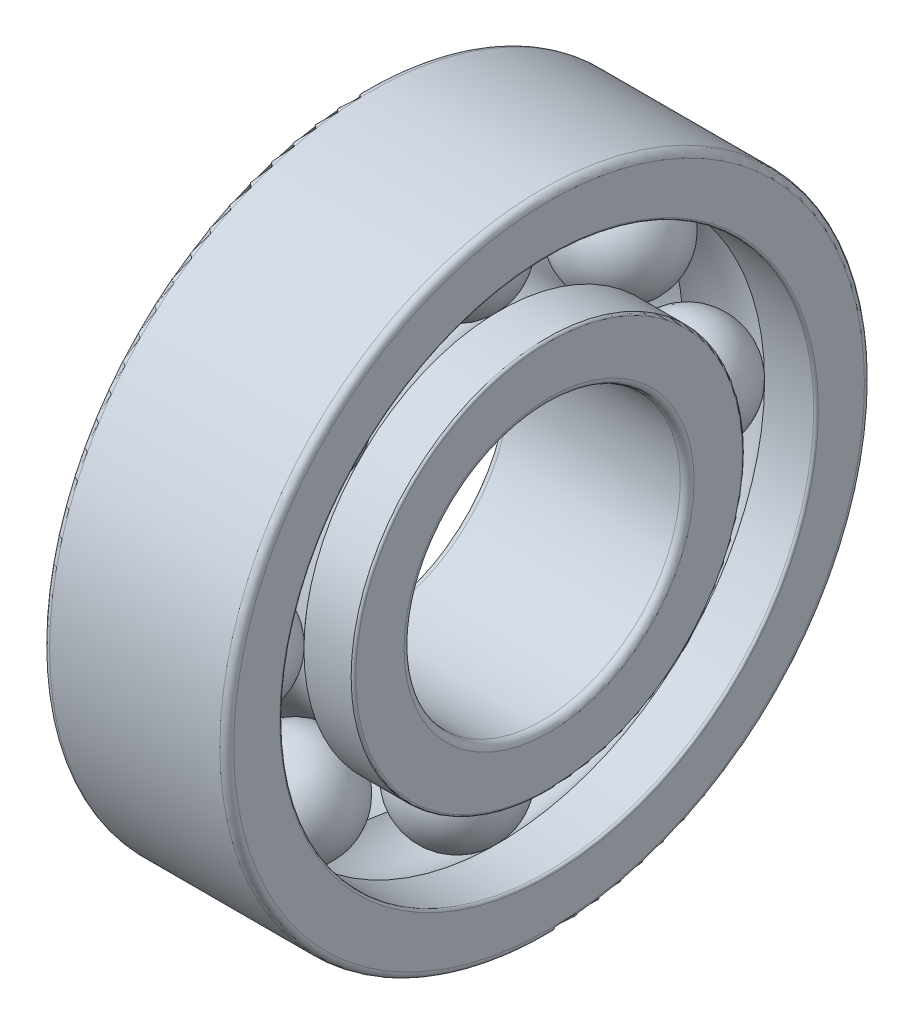
ISO-10303-21;
HEADER;
FILE_DESCRIPTION(('STEP AP214'),'2;1');
FILE_NAME('part.step','',(''),(''),'','','');
FILE_SCHEMA(('AUTOMOTIVE_DESIGN { 1 0 10303 214 1 1 1 1 }'));
ENDSEC;
DATA;
#1=APPLICATION_CONTEXT('core data for automotive mechanical design processes');
#2=APPLICATION_PROTOCOL_DEFINITION('international standard','automotive_design',2000,#1);
#3=PRODUCT_CONTEXT('',#1,'mechanical');
#4=PRODUCT('Part','Part','',(#3));
#5=PRODUCT_RELATED_PRODUCT_CATEGORY('part','',(#4));
#6=PRODUCT_DEFINITION_FORMATION('','',#4);
#7=PRODUCT_DEFINITION_CONTEXT('part definition',#1,'design');
#8=PRODUCT_DEFINITION('design','',#6,#7);
#9=PRODUCT_DEFINITION_SHAPE('','',#8);
#10=(LENGTH_UNIT() NAMED_UNIT(*) SI_UNIT(.MILLI.,.METRE.));
#11=(NAMED_UNIT(*) PLANE_ANGLE_UNIT() SI_UNIT($,.RADIAN.));
#12=(NAMED_UNIT(*) SI_UNIT($,.STERADIAN.) SOLID_ANGLE_UNIT());
#13=UNCERTAINTY_MEASURE_WITH_UNIT(LENGTH_MEASURE(1.E-05),#10,'distance_accuracy_value','');
#14=(GEOMETRIC_REPRESENTATION_CONTEXT(3) GLOBAL_UNCERTAINTY_ASSIGNED_CONTEXT((#13)) GLOBAL_UNIT_ASSIGNED_CONTEXT((#10,
#11,#12)) REPRESENTATION_CONTEXT('',''));
#15=CARTESIAN_POINT('',(0.,0.,0.));
#16=DIRECTION('',(0.,0.,1.));
#17=DIRECTION('',(1.,0.,0.));
#18=AXIS2_PLACEMENT_3D('',#15,#16,#17);
#19=CARTESIAN_POINT('',(4.,7.071067811865,-7.0710678118655));
#20=DIRECTION('',(-1.,0.,0.));
#21=DIRECTION('',(0.,1.,0.));
#22=AXIS2_PLACEMENT_3D('',#19,#20,#21);
#23=SPHERICAL_SURFACE('',#22,2.381);
#24=CARTESIAN_POINT('',(1.619,7.071067811865,-7.0710678118655));
#25=VERTEX_POINT('',#24);
#26=VERTEX_LOOP('',#25);
#27=FACE_BOUND('',#26,.T.);
#28=ADVANCED_FACE('P0_F13',(#27),#23,.T.);
#29=CLOSED_SHELL('',(#28));
#30=MANIFOLD_SOLID_BREP('P0_B1',#29);
#31=CARTESIAN_POINT('',(4.,0.,-10.));
#32=DIRECTION('',(-1.,0.,0.));
#33=DIRECTION('',(0.,1.,0.));
#34=AXIS2_PLACEMENT_3D('',#31,#32,#33);
#35=SPHERICAL_SURFACE('',#34,2.381);
#36=CARTESIAN_POINT('',(1.619,0.,-10.));
#37=VERTEX_POINT('',#36);
#38=VERTEX_LOOP('',#37);
#39=FACE_BOUND('',#38,.T.);
#40=ADVANCED_FACE('P1_F13',(#39),#35,.T.);
#41=CLOSED_SHELL('',(#40));
#42=MANIFOLD_SOLID_BREP('P1_B1',#41);
#43=CARTESIAN_POINT('',(4.,-7.0710678118655,-7.0710678118655));
#44=DIRECTION('',(-1.,0.,0.));
#45=DIRECTION('',(0.,1.,0.));
#46=AXIS2_PLACEMENT_3D('',#43,#44,#45);
#47=SPHERICAL_SURFACE('',#46,2.381);
#48=CARTESIAN_POINT('',(1.619,-7.0710678118655,-7.0710678118655));
#49=VERTEX_POINT('',#48);
#50=VERTEX_LOOP('',#49);
#51=FACE_BOUND('',#50,.T.);
#52=ADVANCED_FACE('P2_F13',(#51),#47,.T.);
#53=CLOSED_SHELL('',(#52));
#54=MANIFOLD_SOLID_BREP('P2_B1',#53);
#55=CARTESIAN_POINT('',(4.,-10.,0.));
#56=DIRECTION('',(-1.,0.,0.));
#57=DIRECTION('',(0.,1.,0.));
#58=AXIS2_PLACEMENT_3D('',#55,#56,#57);
#59=SPHERICAL_SURFACE('',#58,2.381);
#60=CARTESIAN_POINT('',(1.619,-10.,0.));
#61=VERTEX_POINT('',#60);
#62=VERTEX_LOOP('',#61);
#63=FACE_BOUND('',#62,.T.);
#64=ADVANCED_FACE('P3_F13',(#63),#59,.T.);
#65=CLOSED_SHELL('',(#64));
#66=MANIFOLD_SOLID_BREP('P3_B1',#65);
#67=CARTESIAN_POINT('',(4.,-7.0710678118655,7.0710678118655));
#68=DIRECTION('',(-1.,0.,0.));
#69=DIRECTION('',(0.,1.,0.));
#70=AXIS2_PLACEMENT_3D('',#67,#68,#69);
#71=SPHERICAL_SURFACE('',#70,2.381);
#72=CARTESIAN_POINT('',(1.619,-7.0710678118655,7.0710678118655));
#73=VERTEX_POINT('',#72);
#74=VERTEX_LOOP('',#73);
#75=FACE_BOUND('',#74,.T.);
#76=ADVANCED_FACE('P4_F13',(#75),#71,.T.);
#77=CLOSED_SHELL('',(#76));
#78=MANIFOLD_SOLID_BREP('P4_B1',#77);
#79=CARTESIAN_POINT('',(4.,0.,10.));
#80=DIRECTION('',(-1.,0.,0.));
#81=DIRECTION('',(0.,1.,0.));
#82=AXIS2_PLACEMENT_3D('',#79,#80,#81);
#83=SPHERICAL_SURFACE('',#82,2.381);
#84=CARTESIAN_POINT('',(1.619,0.,10.));
#85=VERTEX_POINT('',#84);
#86=VERTEX_LOOP('',#85);
#87=FACE_BOUND('',#86,.T.);
#88=ADVANCED_FACE('P5_F13',(#87),#83,.T.);
#89=CLOSED_SHELL('',(#88));
#90=MANIFOLD_SOLID_BREP('P5_B1',#89);
#91=CARTESIAN_POINT('',(4.,7.071067811865,7.0710678118655));
#92=DIRECTION('',(-1.,0.,0.));
#93=DIRECTION('',(0.,1.,0.));
#94=AXIS2_PLACEMENT_3D('',#91,#92,#93);
#95=SPHERICAL_SURFACE('',#94,2.381);
#96=CARTESIAN_POINT('',(1.619,7.071067811865,7.0710678118655));
#97=VERTEX_POINT('',#96);
#98=VERTEX_LOOP('',#97);
#99=FACE_BOUND('',#98,.T.);
#100=ADVANCED_FACE('P6_F13',(#99),#95,.T.);
#101=CLOSED_SHELL('',(#100));
#102=MANIFOLD_SOLID_BREP('P6_B1',#101);
#103=CARTESIAN_POINT('',(4.,10.,0.));
#104=DIRECTION('',(-1.,0.,0.));
#105=DIRECTION('',(0.,1.,0.));
#106=AXIS2_PLACEMENT_3D('',#103,#104,#105);
#107=SPHERICAL_SURFACE('',#106,2.381);
#108=CARTESIAN_POINT('',(1.619,10.,0.));
#109=VERTEX_POINT('',#108);
#110=VERTEX_LOOP('',#109);
#111=FACE_BOUND('',#110,.T.);
#112=ADVANCED_FACE('P7_F13',(#111),#107,.T.);
#113=CLOSED_SHELL('',(#112));
#114=MANIFOLD_SOLID_BREP('P7_B1',#113);
#115=CARTESIAN_POINT('',(0.,8.62952124433399,8.4));
#116=DIRECTION('',(-1.,0.,0.));
#117=DIRECTION('',(0.,0.,-1.));
#118=AXIS2_PLACEMENT_3D('',#115,#116,#117);
#119=PLANE('',#118);
#120=CARTESIAN_POINT('',(0.,0.,0.));
#121=DIRECTION('',(-1.,0.,0.));
#122=DIRECTION('',(0.,0.,1.));
#123=AXIS2_PLACEMENT_3D('',#120,#121,#122);
#124=CIRCLE('',#123,8.4);
#125=CARTESIAN_POINT('',(0.,0.,8.4));
#126=VERTEX_POINT('',#125);
#127=EDGE_CURVE('P8_E50',#126,#126,#124,.F.);
#128=ORIENTED_EDGE('',*,*,#127,.F.);
#129=EDGE_LOOP('',(#128));
#130=FACE_BOUND('',#129,.T.);
#131=CARTESIAN_POINT('',(0.,0.,0.));
#132=DIRECTION('',(1.,0.,0.));
#133=DIRECTION('',(0.,0.,-1.));
#134=AXIS2_PLACEMENT_3D('',#131,#132,#133);
#135=CIRCLE('',#134,6.30000001843172);
#136=CARTESIAN_POINT('',(0.,0.,-6.30000001843172));
#137=VERTEX_POINT('',#136);
#138=EDGE_CURVE('P8_E47',#137,#137,#135,.T.);
#139=ORIENTED_EDGE('',*,*,#138,.T.);
#140=EDGE_LOOP('',(#139));
#141=FACE_BOUND('',#140,.T.);
#142=ADVANCED_FACE('P8_F15',(#130,#141),#119,.T.);
#143=CARTESIAN_POINT('',(8.,8.62952124433399,-8.4));
#144=DIRECTION('',(1.,0.,0.));
#145=DIRECTION('',(0.,0.,1.));
#146=AXIS2_PLACEMENT_3D('',#143,#144,#145);
#147=PLANE('',#146);
#148=CARTESIAN_POINT('',(8.,0.,0.));
#149=DIRECTION('',(1.,0.,0.));
#150=DIRECTION('',(0.,0.,-1.));
#151=AXIS2_PLACEMENT_3D('',#148,#149,#150);
#152=CIRCLE('',#151,8.40000003233946);
#153=CARTESIAN_POINT('',(8.,0.,-8.40000003233946));
#154=VERTEX_POINT('',#153);
#155=EDGE_CURVE('P8_E44',#154,#154,#152,.T.);
#156=ORIENTED_EDGE('',*,*,#155,.T.);
#157=EDGE_LOOP('',(#156));
#158=FACE_BOUND('',#157,.T.);
#159=CARTESIAN_POINT('',(8.,0.,0.));
#160=DIRECTION('',(-1.,0.,0.));
#161=DIRECTION('',(0.,0.,1.));
#162=AXIS2_PLACEMENT_3D('',#159,#160,#161);
#163=CIRCLE('',#162,6.30000005327022);
#164=CARTESIAN_POINT('',(8.,0.,6.30000005327022));
#165=VERTEX_POINT('',#164);
#166=EDGE_CURVE('P8_E41',#165,#165,#163,.F.);
#167=ORIENTED_EDGE('',*,*,#166,.F.);
#168=EDGE_LOOP('',(#167));
#169=FACE_BOUND('',#168,.T.);
#170=ADVANCED_FACE('P8_F58',(#158,#169),#147,.T.);
#171=CARTESIAN_POINT('',(0.299999999999939,0.,0.));
#172=DIRECTION('',(1.,0.,0.));
#173=DIRECTION('',(0.,0.,-1.));
#174=AXIS2_PLACEMENT_3D('',#171,#172,#173);
#175=TOROIDAL_SURFACE('',#174,6.3,0.299999999999939);
#176=CARTESIAN_POINT('',(0.299999999999994,0.,0.));
#177=DIRECTION('',(1.,0.,0.));
#178=DIRECTION('',(0.,0.,-1.));
#179=AXIS2_PLACEMENT_3D('',#176,#177,#178);
#180=CIRCLE('',#179,6.00000000000006);
#181=CARTESIAN_POINT('',(0.299999999999994,0.,-6.00000000000006));
#182=VERTEX_POINT('',#181);
#183=EDGE_CURVE('P8_E38',#182,#182,#180,.T.);
#184=ORIENTED_EDGE('',*,*,#183,.T.);
#185=EDGE_LOOP('',(#184));
#186=FACE_BOUND('',#185,.T.);
#187=ORIENTED_EDGE('',*,*,#138,.F.);
#188=EDGE_LOOP('',(#187));
#189=FACE_BOUND('',#188,.T.);
#190=ADVANCED_FACE('P8_F62',(#186,#189),#175,.T.);
#191=CARTESIAN_POINT('',(100.,0.,0.));
#192=DIRECTION('',(1.,0.,0.));
#193=DIRECTION('',(0.,0.,-1.));
#194=AXIS2_PLACEMENT_3D('',#191,#192,#193);
#195=CYLINDRICAL_SURFACE('',#194,6.);
#196=CARTESIAN_POINT('',(7.7,0.,0.));
#197=DIRECTION('',(1.,0.,0.));
#198=DIRECTION('',(0.,0.,-1.));
#199=AXIS2_PLACEMENT_3D('',#196,#197,#198);
#200=CIRCLE('',#199,6.);
#201=CARTESIAN_POINT('',(7.7,0.,-6.));
#202=VERTEX_POINT('',#201);
#203=EDGE_CURVE('P8_E35',#202,#202,#200,.T.);
#204=ORIENTED_EDGE('',*,*,#203,.T.);
#205=EDGE_LOOP('',(#204));
#206=FACE_BOUND('',#205,.T.);
#207=ORIENTED_EDGE('',*,*,#183,.F.);
#208=EDGE_LOOP('',(#207));
#209=FACE_BOUND('',#208,.T.);
#210=ADVANCED_FACE('P8_F64',(#206,#209),#195,.F.);
#211=CARTESIAN_POINT('',(7.70000000000013,0.,0.));
#212=DIRECTION('',(1.,0.,0.));
#213=DIRECTION('',(0.,0.,-1.));
#214=AXIS2_PLACEMENT_3D('',#211,#212,#213);
#215=TOROIDAL_SURFACE('',#214,6.29999999999987,0.299999999999874);
#216=ORIENTED_EDGE('',*,*,#166,.T.);
#217=EDGE_LOOP('',(#216));
#218=FACE_BOUND('',#217,.T.);
#219=ORIENTED_EDGE('',*,*,#203,.F.);
#220=EDGE_LOOP('',(#219));
#221=FACE_BOUND('',#220,.T.);
#222=ADVANCED_FACE('P8_F72',(#218,#221),#215,.T.);
#223=CARTESIAN_POINT('',(7.90000000000016,0.,0.));
#224=DIRECTION('',(1.,0.,0.));
#225=DIRECTION('',(0.,0.,-1.));
#226=AXIS2_PLACEMENT_3D('',#223,#224,#225);
#227=TOROIDAL_SURFACE('',#226,8.40000000000016,0.099999999999845);
#228=CARTESIAN_POINT('',(7.90000000000016,0.,0.));
#229=DIRECTION('',(1.,0.,0.));
#230=DIRECTION('',(0.,0.,-1.));
#231=AXIS2_PLACEMENT_3D('',#228,#229,#230);
#232=CIRCLE('',#231,8.50000000000001);
#233=CARTESIAN_POINT('',(7.90000000000016,0.,-8.50000000000001));
#234=VERTEX_POINT('',#233);
#235=EDGE_CURVE('P8_E30',#234,#234,#232,.T.);
#236=ORIENTED_EDGE('',*,*,#235,.T.);
#237=EDGE_LOOP('',(#236));
#238=FACE_BOUND('',#237,.T.);
#239=ORIENTED_EDGE('',*,*,#155,.F.);
#240=EDGE_LOOP('',(#239));
#241=FACE_BOUND('',#240,.T.);
#242=ADVANCED_FACE('P8_F80',(#238,#241),#227,.T.);
#243=CARTESIAN_POINT('',(100.,0.,0.));
#244=DIRECTION('',(1.,0.,0.));
#245=DIRECTION('',(0.,0.,-1.));
#246=AXIS2_PLACEMENT_3D('',#243,#244,#245);
#247=CYLINDRICAL_SURFACE('',#246,8.5);
#248=CARTESIAN_POINT('',(5.84909734735629,0.,0.));
#249=DIRECTION('',(1.,0.,0.));
#250=DIRECTION('',(0.,0.,-1.));
#251=AXIS2_PLACEMENT_3D('',#248,#249,#250);
#252=CIRCLE('',#251,8.5);
#253=CARTESIAN_POINT('',(5.84909734735629,0.,-8.5));
#254=VERTEX_POINT('',#253);
#255=EDGE_CURVE('P8_E26',#254,#254,#252,.T.);
#256=ORIENTED_EDGE('',*,*,#255,.T.);
#257=EDGE_LOOP('',(#256));
#258=FACE_BOUND('',#257,.T.);
#259=ORIENTED_EDGE('',*,*,#235,.F.);
#260=EDGE_LOOP('',(#259));
#261=FACE_BOUND('',#260,.T.);
#262=ADVANCED_FACE('P8_F84',(#258,#261),#247,.T.);
#263=CARTESIAN_POINT('',(4.,0.,0.));
#264=DIRECTION('',(1.,0.,0.));
#265=DIRECTION('',(0.,0.,-1.));
#266=AXIS2_PLACEMENT_3D('',#263,#264,#265);
#267=TOROIDAL_SURFACE('',#266,10.,2.38100000000006);
#268=ORIENTED_EDGE('',*,*,#255,.F.);
#269=EDGE_LOOP('',(#268));
#270=FACE_BOUND('',#269,.T.);
#271=CARTESIAN_POINT('',(2.15090265264367,0.,0.));
#272=DIRECTION('',(1.,0.,0.));
#273=DIRECTION('',(0.,0.,-1.));
#274=AXIS2_PLACEMENT_3D('',#271,#272,#273);
#275=CIRCLE('',#274,8.49999999999998);
#276=CARTESIAN_POINT('',(2.15090265264367,0.,-8.49999999999998));
#277=VERTEX_POINT('',#276);
#278=EDGE_CURVE('P8_E22',#277,#277,#275,.T.);
#279=ORIENTED_EDGE('',*,*,#278,.T.);
#280=EDGE_LOOP('',(#279));
#281=FACE_BOUND('',#280,.T.);
#282=ADVANCED_FACE('P8_F88',(#270,#281),#267,.F.);
#283=CARTESIAN_POINT('',(100.,0.,0.));
#284=DIRECTION('',(1.,0.,0.));
#285=DIRECTION('',(0.,0.,-1.));
#286=AXIS2_PLACEMENT_3D('',#283,#284,#285);
#287=CYLINDRICAL_SURFACE('',#286,8.5);
#288=CARTESIAN_POINT('',(0.100000000000009,0.,0.));
#289=DIRECTION('',(1.,0.,0.));
#290=DIRECTION('',(0.,0.,-1.));
#291=AXIS2_PLACEMENT_3D('',#288,#289,#290);
#292=CIRCLE('',#291,8.5);
#293=CARTESIAN_POINT('',(0.100000000000009,0.,-8.5));
#294=VERTEX_POINT('',#293);
#295=EDGE_CURVE('P8_E10',#294,#294,#292,.T.);
#296=ORIENTED_EDGE('',*,*,#295,.T.);
#297=EDGE_LOOP('',(#296));
#298=FACE_BOUND('',#297,.T.);
#299=ORIENTED_EDGE('',*,*,#278,.F.);
#300=EDGE_LOOP('',(#299));
#301=FACE_BOUND('',#300,.T.);
#302=ADVANCED_FACE('P8_F91',(#298,#301),#287,.T.);
#303=CARTESIAN_POINT('',(0.0999999999999242,0.,0.));
#304=DIRECTION('',(1.,0.,0.));
#305=DIRECTION('',(0.,0.,-1.));
#306=AXIS2_PLACEMENT_3D('',#303,#304,#305);
#307=TOROIDAL_SURFACE('',#306,8.4,0.0999999999999231);
#308=ORIENTED_EDGE('',*,*,#127,.T.);
#309=EDGE_LOOP('',(#308));
#310=FACE_BOUND('',#309,.T.);
#311=ORIENTED_EDGE('',*,*,#295,.F.);
#312=EDGE_LOOP('',(#311));
#313=FACE_BOUND('',#312,.T.);
#314=ADVANCED_FACE('P8_F17',(#310,#313),#307,.T.);
#315=CLOSED_SHELL('',(#142,#170,#190,#210,#222,#242,#262,#282,#302,#314));
#316=MANIFOLD_SOLID_BREP('P8_B1',#315);
#317=CARTESIAN_POINT('',(0.,13.9544959092762,13.7));
#318=DIRECTION('',(-1.,0.,0.));
#319=DIRECTION('',(0.,0.,-1.));
#320=AXIS2_PLACEMENT_3D('',#317,#318,#319);
#321=PLANE('',#320);
#322=CARTESIAN_POINT('',(0.,0.,0.));
#323=DIRECTION('',(-1.,0.,0.));
#324=DIRECTION('',(0.,0.,1.));
#325=AXIS2_PLACEMENT_3D('',#322,#323,#324);
#326=CIRCLE('',#325,13.7);
#327=CARTESIAN_POINT('',(0.,0.,13.7));
#328=VERTEX_POINT('',#327);
#329=EDGE_CURVE('P9_E49',#328,#328,#326,.F.);
#330=ORIENTED_EDGE('',*,*,#329,.F.);
#331=EDGE_LOOP('',(#330));
#332=FACE_BOUND('',#331,.T.);
#333=CARTESIAN_POINT('',(0.,0.,0.));
#334=DIRECTION('',(1.,0.,0.));
#335=DIRECTION('',(0.,0.,-1.));
#336=AXIS2_PLACEMENT_3D('',#333,#334,#335);
#337=CIRCLE('',#336,11.6999999999994);
#338=CARTESIAN_POINT('',(0.,0.,-11.6999999999994));
#339=VERTEX_POINT('',#338);
#340=EDGE_CURVE('P9_E46',#339,#339,#337,.T.);
#341=ORIENTED_EDGE('',*,*,#340,.T.);
#342=EDGE_LOOP('',(#341));
#343=FACE_BOUND('',#342,.T.);
#344=ADVANCED_FACE('P9_F14',(#332,#343),#321,.T.);
#345=CARTESIAN_POINT('',(8.,13.9544959092762,-13.7));
#346=DIRECTION('',(1.,0.,0.));
#347=DIRECTION('',(0.,0.,1.));
#348=AXIS2_PLACEMENT_3D('',#345,#346,#347);
#349=PLANE('',#348);
#350=CARTESIAN_POINT('',(8.,0.,0.));
#351=DIRECTION('',(1.,0.,0.));
#352=DIRECTION('',(0.,0.,-1.));
#353=AXIS2_PLACEMENT_3D('',#350,#351,#352);
#354=CIRCLE('',#353,13.7000000587984);
#355=CARTESIAN_POINT('',(8.,0.,-13.7000000587984));
#356=VERTEX_POINT('',#355);
#357=EDGE_CURVE('P9_E43',#356,#356,#354,.T.);
#358=ORIENTED_EDGE('',*,*,#357,.T.);
#359=EDGE_LOOP('',(#358));
#360=FACE_BOUND('',#359,.T.);
#361=CARTESIAN_POINT('',(8.,0.,0.));
#362=DIRECTION('',(-1.,0.,0.));
#363=DIRECTION('',(0.,0.,1.));
#364=AXIS2_PLACEMENT_3D('',#361,#362,#363);
#365=CIRCLE('',#364,11.7000000258519);
#366=CARTESIAN_POINT('',(8.,0.,11.7000000258519));
#367=VERTEX_POINT('',#366);
#368=EDGE_CURVE('P9_E40',#367,#367,#365,.F.);
#369=ORIENTED_EDGE('',*,*,#368,.F.);
#370=EDGE_LOOP('',(#369));
#371=FACE_BOUND('',#370,.T.);
#372=ADVANCED_FACE('P9_F58',(#360,#371),#349,.T.);
#373=CARTESIAN_POINT('',(0.299999999999938,0.,0.));
#374=DIRECTION('',(1.,0.,0.));
#375=DIRECTION('',(0.,-1.92336047429162E-10,-1.));
#376=AXIS2_PLACEMENT_3D('',#373,#374,#375);
#377=TOROIDAL_SURFACE('',#376,13.7,0.299999999999938);
#378=ORIENTED_EDGE('',*,*,#329,.T.);
#379=EDGE_LOOP('',(#378));
#380=FACE_BOUND('',#379,.T.);
#381=CARTESIAN_POINT('',(0.299999999999938,0.,0.));
#382=DIRECTION('',(-1.,0.,0.));
#383=DIRECTION('',(0.,0.,1.));
#384=AXIS2_PLACEMENT_3D('',#381,#382,#383);
#385=CIRCLE('',#384,13.9999999999999);
#386=CARTESIAN_POINT('',(0.299999999999938,0.,13.9999999999999));
#387=VERTEX_POINT('',#386);
#388=EDGE_CURVE('P9_E37',#387,#387,#385,.F.);
#389=ORIENTED_EDGE('',*,*,#388,.F.);
#390=EDGE_LOOP('',(#389));
#391=FACE_BOUND('',#390,.T.);
#392=ADVANCED_FACE('P9_F53',(#380,#391),#377,.T.);
#393=CARTESIAN_POINT('',(0.0999999999994114,0.,0.));
#394=DIRECTION('',(1.,0.,0.));
#395=DIRECTION('',(0.,0.,-1.));
#396=AXIS2_PLACEMENT_3D('',#393,#394,#395);
#397=TOROIDAL_SURFACE('',#396,11.6999999999994,0.0999999999994114);
#398=CARTESIAN_POINT('',(0.100000000000003,0.,0.));
#399=DIRECTION('',(1.,0.,0.));
#400=DIRECTION('',(0.,0.,-1.));
#401=AXIS2_PLACEMENT_3D('',#398,#399,#400);
#402=CIRCLE('',#401,11.6);
#403=CARTESIAN_POINT('',(0.100000000000003,0.,-11.6));
#404=VERTEX_POINT('',#403);
#405=EDGE_CURVE('P9_E34',#404,#404,#402,.T.);
#406=ORIENTED_EDGE('',*,*,#405,.T.);
#407=EDGE_LOOP('',(#406));
#408=FACE_BOUND('',#407,.T.);
#409=ORIENTED_EDGE('',*,*,#340,.F.);
#410=EDGE_LOOP('',(#409));
#411=FACE_BOUND('',#410,.T.);
#412=ADVANCED_FACE('P9_F62',(#408,#411),#397,.T.);
#413=CARTESIAN_POINT('',(50.,0.,0.));
#414=DIRECTION('',(1.,0.,0.));
#415=DIRECTION('',(0.,0.,-1.));
#416=AXIS2_PLACEMENT_3D('',#413,#414,#415);
#417=CYLINDRICAL_SURFACE('',#416,11.6);
#418=CARTESIAN_POINT('',(2.236718683817,0.,0.));
#419=DIRECTION('',(1.,0.,0.));
#420=DIRECTION('',(0.,0.,-1.));
#421=AXIS2_PLACEMENT_3D('',#418,#419,#420);
#422=CIRCLE('',#421,11.6);
#423=CARTESIAN_POINT('',(2.236718683817,0.,-11.6));
#424=VERTEX_POINT('',#423);
#425=EDGE_CURVE('P9_E29',#424,#424,#422,.T.);
#426=ORIENTED_EDGE('',*,*,#425,.T.);
#427=EDGE_LOOP('',(#426));
#428=FACE_BOUND('',#427,.T.);
#429=ORIENTED_EDGE('',*,*,#405,.F.);
#430=EDGE_LOOP('',(#429));
#431=FACE_BOUND('',#430,.T.);
#432=ADVANCED_FACE('P9_F64',(#428,#431),#417,.F.);
#433=CARTESIAN_POINT('',(4.,0.,0.));
#434=DIRECTION('',(1.,0.,0.));
#435=DIRECTION('',(0.,0.,-1.));
#436=AXIS2_PLACEMENT_3D('',#433,#434,#435);
#437=TOROIDAL_SURFACE('',#436,10.,2.38100000000003);
#438=ORIENTED_EDGE('',*,*,#425,.F.);
#439=EDGE_LOOP('',(#438));
#440=FACE_BOUND('',#439,.T.);
#441=CARTESIAN_POINT('',(5.76328131618302,0.,0.));
#442=DIRECTION('',(1.,0.,0.));
#443=DIRECTION('',(0.,0.,-1.));
#444=AXIS2_PLACEMENT_3D('',#441,#442,#443);
#445=CIRCLE('',#444,11.6);
#446=CARTESIAN_POINT('',(5.76328131618302,0.,-11.6));
#447=VERTEX_POINT('',#446);
#448=EDGE_CURVE('P9_E25',#447,#447,#445,.T.);
#449=ORIENTED_EDGE('',*,*,#448,.T.);
#450=EDGE_LOOP('',(#449));
#451=FACE_BOUND('',#450,.T.);
#452=ADVANCED_FACE('P9_F72',(#440,#451),#437,.F.);
#453=CARTESIAN_POINT('',(50.,0.,0.));
#454=DIRECTION('',(1.,0.,0.));
#455=DIRECTION('',(0.,0.,-1.));
#456=AXIS2_PLACEMENT_3D('',#453,#454,#455);
#457=CYLINDRICAL_SURFACE('',#456,11.6);
#458=CARTESIAN_POINT('',(7.9,0.,0.));
#459=DIRECTION('',(1.,0.,0.));
#460=DIRECTION('',(0.,0.,-1.));
#461=AXIS2_PLACEMENT_3D('',#458,#459,#460);
#462=CIRCLE('',#461,11.6);
#463=CARTESIAN_POINT('',(7.9,0.,-11.6));
#464=VERTEX_POINT('',#463);
#465=EDGE_CURVE('P9_E21',#464,#464,#462,.T.);
#466=ORIENTED_EDGE('',*,*,#465,.T.);
#467=EDGE_LOOP('',(#466));
#468=FACE_BOUND('',#467,.T.);
#469=ORIENTED_EDGE('',*,*,#448,.F.);
#470=EDGE_LOOP('',(#469));
#471=FACE_BOUND('',#470,.T.);
#472=ADVANCED_FACE('P9_F80',(#468,#471),#457,.F.);
#473=CARTESIAN_POINT('',(7.90000000000067,0.,0.));
#474=DIRECTION('',(1.,0.,0.));
#475=DIRECTION('',(0.,0.,-1.));
#476=AXIS2_PLACEMENT_3D('',#473,#474,#475);
#477=TOROIDAL_SURFACE('',#476,11.6999999999993,0.0999999999993333);
#478=ORIENTED_EDGE('',*,*,#368,.T.);
#479=EDGE_LOOP('',(#478));
#480=FACE_BOUND('',#479,.T.);
#481=ORIENTED_EDGE('',*,*,#465,.F.);
#482=EDGE_LOOP('',(#481));
#483=FACE_BOUND('',#482,.T.);
#484=ADVANCED_FACE('P9_F84',(#480,#483),#477,.T.);
#485=CARTESIAN_POINT('',(7.70000000000013,0.,0.));
#486=DIRECTION('',(1.,0.,0.));
#487=DIRECTION('',(0.,0.,-1.));
#488=AXIS2_PLACEMENT_3D('',#485,#486,#487);
#489=TOROIDAL_SURFACE('',#488,13.7000000000001,0.299999999999875);
#490=CARTESIAN_POINT('',(7.70000000000013,0.,0.));
#491=DIRECTION('',(1.,0.,0.));
#492=DIRECTION('',(0.,0.,-1.));
#493=AXIS2_PLACEMENT_3D('',#490,#491,#492);
#494=CIRCLE('',#493,14.);
#495=CARTESIAN_POINT('',(7.70000000000013,0.,-14.));
#496=VERTEX_POINT('',#495);
#497=EDGE_CURVE('P9_E9',#496,#496,#494,.T.);
#498=ORIENTED_EDGE('',*,*,#497,.T.);
#499=EDGE_LOOP('',(#498));
#500=FACE_BOUND('',#499,.T.);
#501=ORIENTED_EDGE('',*,*,#357,.F.);
#502=EDGE_LOOP('',(#501));
#503=FACE_BOUND('',#502,.T.);
#504=ADVANCED_FACE('P9_F86',(#500,#503),#489,.T.);
#505=CARTESIAN_POINT('',(50.,0.,0.));
#506=DIRECTION('',(1.,0.,0.));
#507=DIRECTION('',(0.,-1.92336047429162E-10,-1.));
#508=AXIS2_PLACEMENT_3D('',#505,#506,#507);
#509=CYLINDRICAL_SURFACE('',#508,14.);
#510=ORIENTED_EDGE('',*,*,#388,.T.);
#511=EDGE_LOOP('',(#510));
#512=FACE_BOUND('',#511,.T.);
#513=ORIENTED_EDGE('',*,*,#497,.F.);
#514=EDGE_LOOP('',(#513));
#515=FACE_BOUND('',#514,.T.);
#516=ADVANCED_FACE('P9_F16',(#512,#515),#509,.T.);
#517=CLOSED_SHELL('',(#344,#372,#392,#412,#432,#452,#472,#484,#504,#516));
#518=MANIFOLD_SOLID_BREP('P9_B1',#517);
#519=ADVANCED_BREP_SHAPE_REPRESENTATION('',(#18,#30,#42,#54,#66,#78,#90,#102,#114,#316,#518),#14);
#520=SHAPE_DEFINITION_REPRESENTATION(#9,#519);
ENDSEC;
END-ISO-10303-21;
